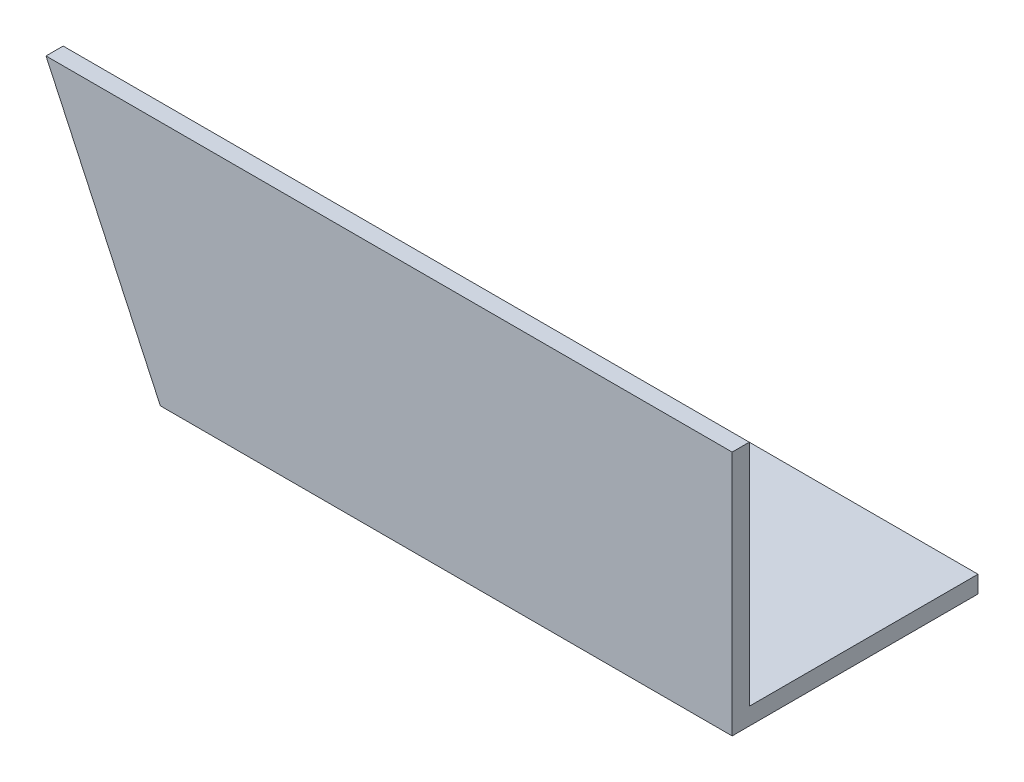
ISO-10303-21;
HEADER;
FILE_DESCRIPTION(('STEP AP214'),'2;1');
FILE_NAME('part.step','',(''),(''),'','','');
FILE_SCHEMA(('AUTOMOTIVE_DESIGN { 1 0 10303 214 1 1 1 1 }'));
ENDSEC;
DATA;
#1=APPLICATION_CONTEXT('core data for automotive mechanical design processes');
#2=APPLICATION_PROTOCOL_DEFINITION('international standard','automotive_design',2000,#1);
#3=PRODUCT_CONTEXT('',#1,'mechanical');
#4=PRODUCT('Part','Part','',(#3));
#5=PRODUCT_RELATED_PRODUCT_CATEGORY('part','',(#4));
#6=PRODUCT_DEFINITION_FORMATION('','',#4);
#7=PRODUCT_DEFINITION_CONTEXT('part definition',#1,'design');
#8=PRODUCT_DEFINITION('design','',#6,#7);
#9=PRODUCT_DEFINITION_SHAPE('','',#8);
#10=(LENGTH_UNIT() NAMED_UNIT(*) SI_UNIT(.MILLI.,.METRE.));
#11=(NAMED_UNIT(*) PLANE_ANGLE_UNIT() SI_UNIT($,.RADIAN.));
#12=(NAMED_UNIT(*) SI_UNIT($,.STERADIAN.) SOLID_ANGLE_UNIT());
#13=UNCERTAINTY_MEASURE_WITH_UNIT(LENGTH_MEASURE(1.E-05),#10,'distance_accuracy_value','');
#14=(GEOMETRIC_REPRESENTATION_CONTEXT(3) GLOBAL_UNCERTAINTY_ASSIGNED_CONTEXT((#13)) GLOBAL_UNIT_ASSIGNED_CONTEXT((#10,
#11,#12)) REPRESENTATION_CONTEXT('',''));
#15=CARTESIAN_POINT('',(0.,0.,0.));
#16=DIRECTION('',(0.,0.,1.));
#17=DIRECTION('',(1.,0.,0.));
#18=AXIS2_PLACEMENT_3D('',#15,#16,#17);
#19=CARTESIAN_POINT('',(120.,-3.,0.));
#20=DIRECTION('',(0.,1.,0.));
#21=DIRECTION('',(0.,0.,1.));
#22=AXIS2_PLACEMENT_3D('',#19,#20,#21);
#23=PLANE('',#22);
#24=CARTESIAN_POINT('',(70.,-3.,-15.));
#25=DIRECTION('',(0.,-1.,0.));
#26=DIRECTION('',(0.,0.,-1.));
#27=AXIS2_PLACEMENT_3D('',#24,#25,#26);
#28=CIRCLE('',#27,5.);
#29=CARTESIAN_POINT('',(70.,-3.,-20.));
#30=VERTEX_POINT('',#29);
#31=EDGE_CURVE('E146',#30,#30,#28,.T.);
#32=ORIENTED_EDGE('',*,*,#31,.F.);
#33=EDGE_LOOP('',(#32));
#34=FACE_BOUND('',#33,.T.);
#35=DIRECTION('',(-1.,0.,0.));
#36=VECTOR('',#35,1.);
#37=CARTESIAN_POINT('',(120.,-3.,3.00000000000001));
#38=LINE('',#37,#36);
#39=CARTESIAN_POINT('',(120.,-3.,3.00000000000001));
#40=VERTEX_POINT('',#39);
#41=CARTESIAN_POINT('',(20.,-3.,3.));
#42=VERTEX_POINT('',#41);
#43=EDGE_CURVE('E95',#40,#42,#38,.T.);
#44=ORIENTED_EDGE('',*,*,#43,.T.);
#45=DIRECTION('',(0.,0.,1.));
#46=VECTOR('',#45,1.);
#47=CARTESIAN_POINT('',(20.,-3.,-47.));
#48=LINE('',#47,#46);
#49=CARTESIAN_POINT('',(20.,-3.,-40.));
#50=VERTEX_POINT('',#49);
#51=EDGE_CURVE('E81',#50,#42,#48,.T.);
#52=ORIENTED_EDGE('',*,*,#51,.F.);
#53=DIRECTION('',(-1.,0.,0.));
#54=VECTOR('',#53,1.);
#55=CARTESIAN_POINT('',(120.,-3.,-40.));
#56=LINE('',#55,#54);
#57=CARTESIAN_POINT('',(120.,-3.,-40.));
#58=VERTEX_POINT('',#57);
#59=EDGE_CURVE('E11',#58,#50,#56,.T.);
#60=ORIENTED_EDGE('',*,*,#59,.F.);
#61=DIRECTION('',(0.,0.,-1.));
#62=VECTOR('',#61,1.);
#63=CARTESIAN_POINT('',(120.,-3.,0.));
#64=LINE('',#63,#62);
#65=EDGE_CURVE('E100',#40,#58,#64,.T.);
#66=ORIENTED_EDGE('',*,*,#65,.F.);
#67=EDGE_LOOP('',(#44,#52,#60,#66));
#68=FACE_BOUND('',#67,.T.);
#69=ADVANCED_FACE('F32',(#34,#68),#23,.F.);
#70=CARTESIAN_POINT('',(120.,0.,-40.));
#71=DIRECTION('',(0.,0.,-1.));
#72=DIRECTION('',(-1.,0.,0.));
#73=AXIS2_PLACEMENT_3D('',#70,#71,#72);
#74=PLANE('',#73);
#75=DIRECTION('',(0.421730749715584,-0.906721111888507,0.));
#76=VECTOR('',#75,1.);
#77=CARTESIAN_POINT('',(36.6385060026678,-38.7727879057359,-40.));
#78=LINE('',#77,#76);
#79=CARTESIAN_POINT('',(18.6046511627907,0.,-40.));
#80=VERTEX_POINT('',#79);
#81=EDGE_CURVE('E87',#80,#50,#78,.T.);
#82=ORIENTED_EDGE('',*,*,#81,.F.);
#83=DIRECTION('',(-1.,0.,0.));
#84=VECTOR('',#83,1.);
#85=CARTESIAN_POINT('',(120.,0.,-40.));
#86=LINE('',#85,#84);
#87=CARTESIAN_POINT('',(120.,0.,-40.));
#88=VERTEX_POINT('',#87);
#89=EDGE_CURVE('E41',#88,#80,#86,.T.);
#90=ORIENTED_EDGE('',*,*,#89,.F.);
#91=DIRECTION('',(0.,-1.,0.));
#92=VECTOR('',#91,1.);
#93=CARTESIAN_POINT('',(120.,0.,-40.));
#94=LINE('',#93,#92);
#95=EDGE_CURVE('E126',#88,#58,#94,.T.);
#96=ORIENTED_EDGE('',*,*,#95,.T.);
#97=ORIENTED_EDGE('',*,*,#59,.T.);
#98=EDGE_LOOP('',(#82,#90,#96,#97));
#99=FACE_BOUND('',#98,.T.);
#100=ADVANCED_FACE('F125',(#99),#74,.T.);
#101=CARTESIAN_POINT('',(120.,0.,0.));
#102=DIRECTION('',(0.,1.,0.));
#103=DIRECTION('',(0.,0.,1.));
#104=AXIS2_PLACEMENT_3D('',#101,#102,#103);
#105=PLANE('',#104);
#106=CARTESIAN_POINT('',(70.,0.,-15.));
#107=DIRECTION('',(0.,1.,0.));
#108=DIRECTION('',(0.,0.,1.));
#109=AXIS2_PLACEMENT_3D('',#106,#107,#108);
#110=CIRCLE('',#109,5.);
#111=CARTESIAN_POINT('',(70.,0.,-9.99999999999999));
#112=VERTEX_POINT('',#111);
#113=EDGE_CURVE('E35',#112,#112,#110,.T.);
#114=ORIENTED_EDGE('',*,*,#113,.F.);
#115=EDGE_LOOP('',(#114));
#116=FACE_BOUND('',#115,.T.);
#117=DIRECTION('',(0.,0.,-1.));
#118=VECTOR('',#117,1.);
#119=CARTESIAN_POINT('',(18.6046511627907,0.,0.));
#120=LINE('',#119,#118);
#121=CARTESIAN_POINT('',(18.6046511627907,0.,0.));
#122=VERTEX_POINT('',#121);
#123=EDGE_CURVE('E119',#122,#80,#120,.T.);
#124=ORIENTED_EDGE('',*,*,#123,.F.);
#125=DIRECTION('',(-1.,0.,0.));
#126=VECTOR('',#125,1.);
#127=CARTESIAN_POINT('',(120.,0.,0.));
#128=LINE('',#127,#126);
#129=CARTESIAN_POINT('',(120.,0.,0.));
#130=VERTEX_POINT('',#129);
#131=EDGE_CURVE('E111',#130,#122,#128,.T.);
#132=ORIENTED_EDGE('',*,*,#131,.F.);
#133=DIRECTION('',(0.,0.,-1.));
#134=VECTOR('',#133,1.);
#135=CARTESIAN_POINT('',(120.,0.,0.));
#136=LINE('',#135,#134);
#137=EDGE_CURVE('E121',#130,#88,#136,.T.);
#138=ORIENTED_EDGE('',*,*,#137,.T.);
#139=ORIENTED_EDGE('',*,*,#89,.T.);
#140=EDGE_LOOP('',(#124,#132,#138,#139));
#141=FACE_BOUND('',#140,.T.);
#142=ADVANCED_FACE('F118',(#116,#141),#105,.T.);
#143=CARTESIAN_POINT('',(120.,40.,-1.19525527596782E-13));
#144=DIRECTION('',(0.,0.,-1.));
#145=DIRECTION('',(0.,1.,0.));
#146=AXIS2_PLACEMENT_3D('',#143,#144,#145);
#147=PLANE('',#146);
#148=DIRECTION('',(0.421730749715584,-0.906721111888507,0.));
#149=VECTOR('',#148,1.);
#150=CARTESIAN_POINT('',(21.3428190306803,-5.88706091596258,0.));
#151=LINE('',#150,#149);
#152=CARTESIAN_POINT('',(0.,40.,-1.17961196366423E-13));
#153=VERTEX_POINT('',#152);
#154=EDGE_CURVE('E91',#153,#122,#151,.T.);
#155=ORIENTED_EDGE('',*,*,#154,.F.);
#156=DIRECTION('',(-1.,0.,0.));
#157=VECTOR('',#156,1.);
#158=CARTESIAN_POINT('',(120.,40.,-1.19525527596782E-13));
#159=LINE('',#158,#157);
#160=CARTESIAN_POINT('',(120.,40.,-1.19525527596782E-13));
#161=VERTEX_POINT('',#160);
#162=EDGE_CURVE('E102',#161,#153,#159,.T.);
#163=ORIENTED_EDGE('',*,*,#162,.F.);
#164=DIRECTION('',(0.,-1.,0.));
#165=VECTOR('',#164,1.);
#166=CARTESIAN_POINT('',(120.,40.,-1.19525527596782E-13));
#167=LINE('',#166,#165);
#168=EDGE_CURVE('E131',#161,#130,#167,.T.);
#169=ORIENTED_EDGE('',*,*,#168,.T.);
#170=ORIENTED_EDGE('',*,*,#131,.T.);
#171=EDGE_LOOP('',(#155,#163,#169,#170));
#172=FACE_BOUND('',#171,.T.);
#173=ADVANCED_FACE('F142',(#172),#147,.T.);
#174=CARTESIAN_POINT('',(120.,40.,2.99999999999988));
#175=DIRECTION('',(0.,1.,0.));
#176=DIRECTION('',(0.,0.,1.));
#177=AXIS2_PLACEMENT_3D('',#174,#175,#176);
#178=PLANE('',#177);
#179=DIRECTION('',(0.,0.,-1.));
#180=VECTOR('',#179,1.);
#181=CARTESIAN_POINT('',(0.,40.,2.99999999999988));
#182=LINE('',#181,#180);
#183=CARTESIAN_POINT('',(0.,40.,2.99999999999988));
#184=VERTEX_POINT('',#183);
#185=EDGE_CURVE('E107',#184,#153,#182,.T.);
#186=ORIENTED_EDGE('',*,*,#185,.F.);
#187=DIRECTION('',(-1.,0.,0.));
#188=VECTOR('',#187,1.);
#189=CARTESIAN_POINT('',(120.,40.,2.99999999999988));
#190=LINE('',#189,#188);
#191=CARTESIAN_POINT('',(120.,40.,2.99999999999988));
#192=VERTEX_POINT('',#191);
#193=EDGE_CURVE('E97',#192,#184,#190,.T.);
#194=ORIENTED_EDGE('',*,*,#193,.F.);
#195=DIRECTION('',(0.,0.,-1.));
#196=VECTOR('',#195,1.);
#197=CARTESIAN_POINT('',(120.,40.,2.99999999999988));
#198=LINE('',#197,#196);
#199=EDGE_CURVE('E104',#192,#161,#198,.T.);
#200=ORIENTED_EDGE('',*,*,#199,.T.);
#201=ORIENTED_EDGE('',*,*,#162,.T.);
#202=EDGE_LOOP('',(#186,#194,#200,#201));
#203=FACE_BOUND('',#202,.T.);
#204=ADVANCED_FACE('F139',(#203),#178,.T.);
#205=CARTESIAN_POINT('',(120.,40.,2.99999999999988));
#206=DIRECTION('',(0.,0.,-1.));
#207=DIRECTION('',(0.,1.,0.));
#208=AXIS2_PLACEMENT_3D('',#205,#206,#207);
#209=PLANE('',#208);
#210=ORIENTED_EDGE('',*,*,#193,.T.);
#211=DIRECTION('',(-0.421730749715584,0.906721111888507,0.));
#212=VECTOR('',#211,1.);
#213=CARTESIAN_POINT('',(0.,40.,3.));
#214=LINE('',#213,#212);
#215=EDGE_CURVE('E84',#42,#184,#214,.T.);
#216=ORIENTED_EDGE('',*,*,#215,.F.);
#217=ORIENTED_EDGE('',*,*,#43,.F.);
#218=DIRECTION('',(0.,-1.,0.));
#219=VECTOR('',#218,1.);
#220=CARTESIAN_POINT('',(120.,40.,2.99999999999988));
#221=LINE('',#220,#219);
#222=EDGE_CURVE('E48',#192,#40,#221,.T.);
#223=ORIENTED_EDGE('',*,*,#222,.F.);
#224=EDGE_LOOP('',(#210,#216,#217,#223));
#225=FACE_BOUND('',#224,.T.);
#226=ADVANCED_FACE('F94',(#225),#209,.F.);
#227=CARTESIAN_POINT('',(120.,0.,0.));
#228=DIRECTION('',(-1.,0.,0.));
#229=DIRECTION('',(0.,0.,1.));
#230=AXIS2_PLACEMENT_3D('',#227,#228,#229);
#231=PLANE('',#230);
#232=ORIENTED_EDGE('',*,*,#65,.T.);
#233=ORIENTED_EDGE('',*,*,#95,.F.);
#234=ORIENTED_EDGE('',*,*,#137,.F.);
#235=ORIENTED_EDGE('',*,*,#168,.F.);
#236=ORIENTED_EDGE('',*,*,#199,.F.);
#237=ORIENTED_EDGE('',*,*,#222,.T.);
#238=EDGE_LOOP('',(#232,#233,#234,#235,#236,#237));
#239=FACE_BOUND('',#238,.T.);
#240=ADVANCED_FACE('F127',(#239),#231,.F.);
#241=CARTESIAN_POINT('',(0.,40.,-47.));
#242=DIRECTION('',(0.906721111888507,0.421730749715584,0.));
#243=DIRECTION('',(-0.421730749715584,0.906721111888507,0.));
#244=AXIS2_PLACEMENT_3D('',#241,#242,#243);
#245=PLANE('',#244);
#246=ORIENTED_EDGE('',*,*,#81,.T.);
#247=ORIENTED_EDGE('',*,*,#51,.T.);
#248=ORIENTED_EDGE('',*,*,#215,.T.);
#249=ORIENTED_EDGE('',*,*,#185,.T.);
#250=ORIENTED_EDGE('',*,*,#154,.T.);
#251=ORIENTED_EDGE('',*,*,#123,.T.);
#252=EDGE_LOOP('',(#246,#247,#248,#249,#250,#251));
#253=FACE_BOUND('',#252,.T.);
#254=ADVANCED_FACE('F83',(#253),#245,.F.);
#255=CARTESIAN_POINT('',(70.,7.,-15.));
#256=DIRECTION('',(0.,-1.,0.));
#257=DIRECTION('',(0.,0.,-1.));
#258=AXIS2_PLACEMENT_3D('',#255,#256,#257);
#259=CYLINDRICAL_SURFACE('',#258,5.);
#260=ORIENTED_EDGE('',*,*,#113,.T.);
#261=EDGE_LOOP('',(#260));
#262=FACE_BOUND('',#261,.T.);
#263=ORIENTED_EDGE('',*,*,#31,.T.);
#264=EDGE_LOOP('',(#263));
#265=FACE_BOUND('',#264,.T.);
#266=ADVANCED_FACE('F153',(#262,#265),#259,.F.);
#267=CLOSED_SHELL('',(#69,#100,#142,#173,#204,#226,#240,#254,#266));
#268=MANIFOLD_SOLID_BREP('B2',#267);
#269=ADVANCED_BREP_SHAPE_REPRESENTATION('',(#18,#268),#14);
#270=SHAPE_DEFINITION_REPRESENTATION(#9,#269);
ENDSEC;
END-ISO-10303-21;
